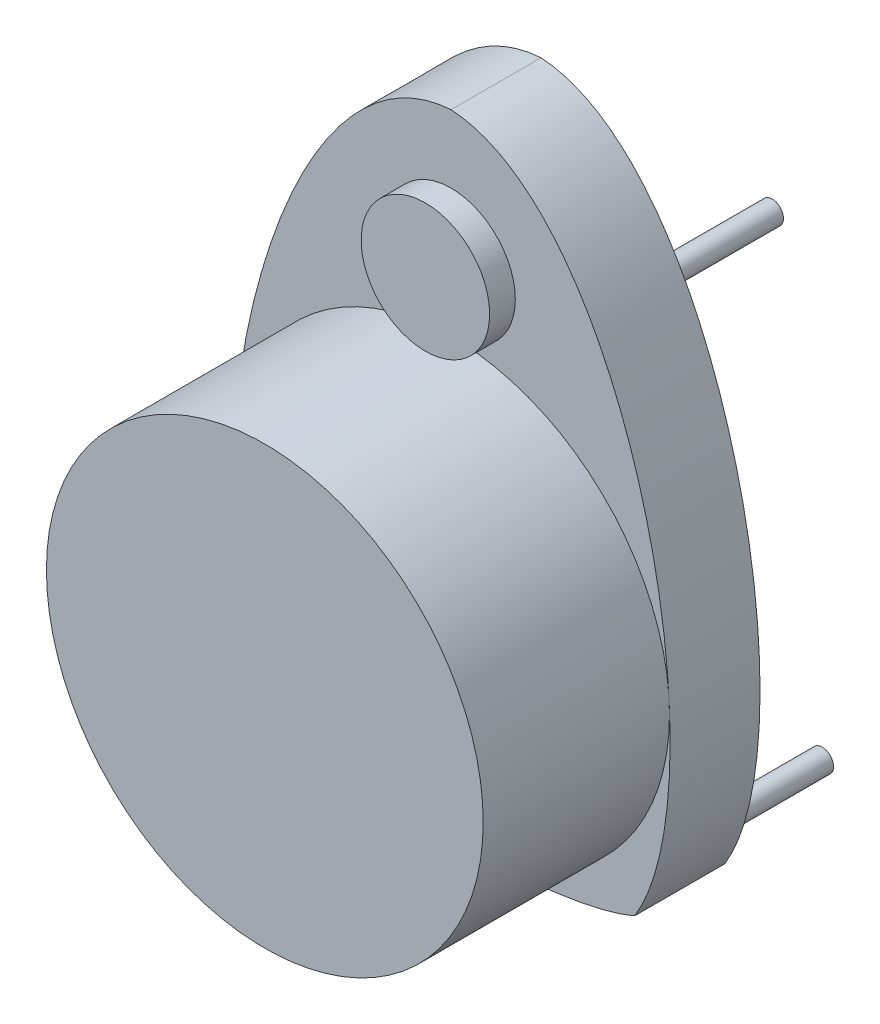
ISO-10303-21;
HEADER;
FILE_DESCRIPTION(('STEP AP214'),'2;1');
FILE_NAME('part.step','',(''),(''),'','','');
FILE_SCHEMA(('AUTOMOTIVE_DESIGN { 1 0 10303 214 1 1 1 1 }'));
ENDSEC;
DATA;
#1=APPLICATION_CONTEXT('core data for automotive mechanical design processes');
#2=APPLICATION_PROTOCOL_DEFINITION('international standard','automotive_design',2000,#1);
#3=PRODUCT_CONTEXT('',#1,'mechanical');
#4=PRODUCT('Part','Part','',(#3));
#5=PRODUCT_RELATED_PRODUCT_CATEGORY('part','',(#4));
#6=PRODUCT_DEFINITION_FORMATION('','',#4);
#7=PRODUCT_DEFINITION_CONTEXT('part definition',#1,'design');
#8=PRODUCT_DEFINITION('design','',#6,#7);
#9=PRODUCT_DEFINITION_SHAPE('','',#8);
#10=(LENGTH_UNIT() NAMED_UNIT(*) SI_UNIT(.MILLI.,.METRE.));
#11=(NAMED_UNIT(*) PLANE_ANGLE_UNIT() SI_UNIT($,.RADIAN.));
#12=(NAMED_UNIT(*) SI_UNIT($,.STERADIAN.) SOLID_ANGLE_UNIT());
#13=UNCERTAINTY_MEASURE_WITH_UNIT(LENGTH_MEASURE(1.E-05),#10,'distance_accuracy_value','');
#14=(GEOMETRIC_REPRESENTATION_CONTEXT(3) GLOBAL_UNCERTAINTY_ASSIGNED_CONTEXT((#13)) GLOBAL_UNIT_ASSIGNED_CONTEXT((#10,
#11,#12)) REPRESENTATION_CONTEXT('',''));
#15=CARTESIAN_POINT('',(0.,0.,0.));
#16=DIRECTION('',(0.,0.,1.));
#17=DIRECTION('',(1.,0.,0.));
#18=AXIS2_PLACEMENT_3D('',#15,#16,#17);
#19=CARTESIAN_POINT('',(28.6113177618945,-29.8036970612146,-14.));
#20=CARTESIAN_POINT('',(42.7740058519947,-6.41287401563133,-14.));
#21=CARTESIAN_POINT('',(28.2258406559311,62.7668121122814,-14.));
#22=CARTESIAN_POINT('',(0.,64.5689508839381,-14.));
#23=B_SPLINE_CURVE_WITH_KNOTS('',3,(#19,#20,#21,#22),.UNSPECIFIED.,.F.,.F.,(4,4),(0.,1.),.UNSPECIFIED.);
#24=DIRECTION('',(0.,0.,1.));
#25=VECTOR('',#24,1.);
#26=SURFACE_OF_LINEAR_EXTRUSION('',#23,#25);
#27=CARTESIAN_POINT('',(28.6113177618945,-29.8036970612146,0.));
#28=CARTESIAN_POINT('',(42.7740058519947,-6.41287401563133,0.));
#29=CARTESIAN_POINT('',(28.2258406559311,62.7668121122814,0.));
#30=CARTESIAN_POINT('',(0.,64.5689508839381,0.));
#31=B_SPLINE_CURVE_WITH_KNOTS('',3,(#27,#28,#29,#30),.UNSPECIFIED.,.F.,.F.,(4,4),(0.,1.),.UNSPECIFIED.);
#32=CARTESIAN_POINT('',(28.6113177618945,-29.8036970612146,0.));
#33=VERTEX_POINT('',#32);
#34=CARTESIAN_POINT('',(0.,64.5689508839381,0.));
#35=VERTEX_POINT('',#34);
#36=EDGE_CURVE('E134',#33,#35,#31,.T.);
#37=ORIENTED_EDGE('',*,*,#36,.F.);
#38=DIRECTION('',(0.,0.,1.));
#39=VECTOR('',#38,1.);
#40=CARTESIAN_POINT('',(28.6113177618945,-29.8036970612146,-14.));
#41=LINE('',#40,#39);
#42=CARTESIAN_POINT('',(28.6113177618945,-29.8036970612146,-14.));
#43=VERTEX_POINT('',#42);
#44=EDGE_CURVE('E59',#43,#33,#41,.T.);
#45=ORIENTED_EDGE('',*,*,#44,.F.);
#46=CARTESIAN_POINT('',(0.,64.5689508839381,-14.));
#47=VERTEX_POINT('',#46);
#48=EDGE_CURVE('E104',#43,#47,#23,.T.);
#49=ORIENTED_EDGE('',*,*,#48,.T.);
#50=DIRECTION('',(0.,0.,1.));
#51=VECTOR('',#50,1.);
#52=CARTESIAN_POINT('',(0.,64.5689508839381,-14.));
#53=LINE('',#52,#51);
#54=EDGE_CURVE('E87',#47,#35,#53,.T.);
#55=ORIENTED_EDGE('',*,*,#54,.T.);
#56=EDGE_LOOP('',(#37,#45,#49,#55));
#57=FACE_BOUND('',#56,.T.);
#58=ADVANCED_FACE('F42',(#57),#26,.T.);
#59=CARTESIAN_POINT('',(0.,-34.,-14.));
#60=CARTESIAN_POINT('',(20.277297814676,-33.507705926645,-14.));
#61=CARTESIAN_POINT('',(28.6113177618945,-29.8036970612146,-14.));
#62=B_SPLINE_CURVE_WITH_KNOTS('',2,(#59,#60,#61),.UNSPECIFIED.,.F.,.F.,(3,3),(0.,1.),.UNSPECIFIED.);
#63=DIRECTION('',(0.,0.,1.));
#64=VECTOR('',#63,1.);
#65=SURFACE_OF_LINEAR_EXTRUSION('',#62,#64);
#66=CARTESIAN_POINT('',(0.,-34.,0.));
#67=CARTESIAN_POINT('',(20.277297814676,-33.507705926645,0.));
#68=CARTESIAN_POINT('',(28.6113177618945,-29.8036970612146,0.));
#69=B_SPLINE_CURVE_WITH_KNOTS('',2,(#66,#67,#68),.UNSPECIFIED.,.F.,.F.,(3,3),(0.,1.),.UNSPECIFIED.);
#70=CARTESIAN_POINT('',(0.,-34.,0.));
#71=VERTEX_POINT('',#70);
#72=EDGE_CURVE('E106',#71,#33,#69,.T.);
#73=ORIENTED_EDGE('',*,*,#72,.F.);
#74=DIRECTION('',(0.,0.,1.));
#75=VECTOR('',#74,1.);
#76=CARTESIAN_POINT('',(0.,-34.,-14.));
#77=LINE('',#76,#75);
#78=CARTESIAN_POINT('',(0.,-34.,-14.));
#79=VERTEX_POINT('',#78);
#80=EDGE_CURVE('E76',#79,#71,#77,.T.);
#81=ORIENTED_EDGE('',*,*,#80,.F.);
#82=EDGE_CURVE('E101',#79,#43,#62,.T.);
#83=ORIENTED_EDGE('',*,*,#82,.T.);
#84=ORIENTED_EDGE('',*,*,#44,.T.);
#85=EDGE_LOOP('',(#73,#81,#83,#84));
#86=FACE_BOUND('',#85,.T.);
#87=ADVANCED_FACE('F125',(#86),#65,.T.);
#88=CARTESIAN_POINT('',(-28.6113177618945,-29.8036970612146,-14.));
#89=CARTESIAN_POINT('',(-20.277297814676,-33.507705926645,-14.));
#90=CARTESIAN_POINT('',(0.,-34.,-14.));
#91=B_SPLINE_CURVE_WITH_KNOTS('',2,(#88,#89,#90),.UNSPECIFIED.,.F.,.F.,(3,3),(0.,1.),.UNSPECIFIED.);
#92=DIRECTION('',(0.,0.,1.));
#93=VECTOR('',#92,1.);
#94=SURFACE_OF_LINEAR_EXTRUSION('',#91,#93);
#95=CARTESIAN_POINT('',(-28.6113177618945,-29.8036970612146,0.));
#96=CARTESIAN_POINT('',(-20.277297814676,-33.507705926645,0.));
#97=CARTESIAN_POINT('',(0.,-34.,0.));
#98=B_SPLINE_CURVE_WITH_KNOTS('',2,(#95,#96,#97),.UNSPECIFIED.,.F.,.F.,(3,3),(0.,1.),.UNSPECIFIED.);
#99=CARTESIAN_POINT('',(-28.6113177618945,-29.8036970612146,0.));
#100=VERTEX_POINT('',#99);
#101=EDGE_CURVE('E95',#100,#71,#98,.T.);
#102=ORIENTED_EDGE('',*,*,#101,.F.);
#103=DIRECTION('',(0.,0.,1.));
#104=VECTOR('',#103,1.);
#105=CARTESIAN_POINT('',(-28.6113177618945,-29.8036970612146,-14.));
#106=LINE('',#105,#104);
#107=CARTESIAN_POINT('',(-28.6113177618945,-29.8036970612146,-14.));
#108=VERTEX_POINT('',#107);
#109=EDGE_CURVE('E90',#108,#100,#106,.T.);
#110=ORIENTED_EDGE('',*,*,#109,.F.);
#111=EDGE_CURVE('E93',#108,#79,#91,.T.);
#112=ORIENTED_EDGE('',*,*,#111,.T.);
#113=ORIENTED_EDGE('',*,*,#80,.T.);
#114=EDGE_LOOP('',(#102,#110,#112,#113));
#115=FACE_BOUND('',#114,.T.);
#116=ADVANCED_FACE('F92',(#115),#94,.T.);
#117=CARTESIAN_POINT('',(0.,64.5689508839381,-14.));
#118=CARTESIAN_POINT('',(-28.2258406559311,62.7668121122814,-14.));
#119=CARTESIAN_POINT('',(-42.7740058519947,-6.41287401563133,-14.));
#120=CARTESIAN_POINT('',(-28.6113177618945,-29.8036970612146,-14.));
#121=B_SPLINE_CURVE_WITH_KNOTS('',3,(#117,#118,#119,#120),.UNSPECIFIED.,.F.,.F.,(4,4),(0.,1.),.UNSPECIFIED.);
#122=DIRECTION('',(0.,0.,1.));
#123=VECTOR('',#122,1.);
#124=SURFACE_OF_LINEAR_EXTRUSION('',#121,#123);
#125=CARTESIAN_POINT('',(0.,64.5689508839381,0.));
#126=CARTESIAN_POINT('',(-28.2258406559311,62.7668121122814,0.));
#127=CARTESIAN_POINT('',(-42.7740058519947,-6.41287401563133,0.));
#128=CARTESIAN_POINT('',(-28.6113177618945,-29.8036970612146,0.));
#129=B_SPLINE_CURVE_WITH_KNOTS('',3,(#125,#126,#127,#128),.UNSPECIFIED.,.F.,.F.,(4,4),(0.,1.),.UNSPECIFIED.);
#130=EDGE_CURVE('E142',#35,#100,#129,.T.);
#131=ORIENTED_EDGE('',*,*,#130,.F.);
#132=ORIENTED_EDGE('',*,*,#54,.F.);
#133=EDGE_CURVE('E100',#47,#108,#121,.T.);
#134=ORIENTED_EDGE('',*,*,#133,.T.);
#135=ORIENTED_EDGE('',*,*,#109,.T.);
#136=EDGE_LOOP('',(#131,#132,#134,#135));
#137=FACE_BOUND('',#136,.T.);
#138=ADVANCED_FACE('F103',(#137),#124,.T.);
#139=CARTESIAN_POINT('',(30.201357160709,25.4783835140842,-14.));
#140=DIRECTION('',(0.,0.,1.));
#141=DIRECTION('',(1.,0.,0.));
#142=AXIS2_PLACEMENT_3D('',#139,#140,#141);
#143=PLANE('',#142);
#144=CARTESIAN_POINT('',(20.,45.7689508839381,-14.));
#145=DIRECTION('',(0.,0.,1.));
#146=DIRECTION('',(1.,0.,0.));
#147=AXIS2_PLACEMENT_3D('',#144,#145,#146);
#148=CIRCLE('',#147,1.75);
#149=CARTESIAN_POINT('',(21.75,45.7689508839381,-14.));
#150=VERTEX_POINT('',#149);
#151=EDGE_CURVE('E12',#150,#150,#148,.F.);
#152=ORIENTED_EDGE('',*,*,#151,.F.);
#153=EDGE_LOOP('',(#152));
#154=FACE_BOUND('',#153,.T.);
#155=CARTESIAN_POINT('',(-27.8,-24.2310491160619,-14.));
#156=DIRECTION('',(0.,0.,1.));
#157=DIRECTION('',(1.,0.,0.));
#158=AXIS2_PLACEMENT_3D('',#155,#156,#157);
#159=CIRCLE('',#158,1.75);
#160=CARTESIAN_POINT('',(-26.05,-24.2310491160619,-14.));
#161=VERTEX_POINT('',#160);
#162=EDGE_CURVE('E51',#161,#161,#159,.F.);
#163=ORIENTED_EDGE('',*,*,#162,.F.);
#164=EDGE_LOOP('',(#163));
#165=FACE_BOUND('',#164,.T.);
#166=CARTESIAN_POINT('',(-20.,45.7689508839381,-14.));
#167=DIRECTION('',(0.,0.,1.));
#168=DIRECTION('',(1.,0.,0.));
#169=AXIS2_PLACEMENT_3D('',#166,#167,#168);
#170=CIRCLE('',#169,1.75);
#171=CARTESIAN_POINT('',(-18.25,45.7689508839381,-14.));
#172=VERTEX_POINT('',#171);
#173=EDGE_CURVE('E172',#172,#172,#170,.F.);
#174=ORIENTED_EDGE('',*,*,#173,.F.);
#175=EDGE_LOOP('',(#174));
#176=FACE_BOUND('',#175,.T.);
#177=CARTESIAN_POINT('',(27.8,-24.2310491160619,-14.));
#178=DIRECTION('',(0.,0.,1.));
#179=DIRECTION('',(1.,0.,0.));
#180=AXIS2_PLACEMENT_3D('',#177,#178,#179);
#181=CIRCLE('',#180,1.75);
#182=CARTESIAN_POINT('',(29.55,-24.2310491160619,-14.));
#183=VERTEX_POINT('',#182);
#184=EDGE_CURVE('E167',#183,#183,#181,.F.);
#185=ORIENTED_EDGE('',*,*,#184,.F.);
#186=EDGE_LOOP('',(#185));
#187=FACE_BOUND('',#186,.T.);
#188=ORIENTED_EDGE('',*,*,#48,.F.);
#189=ORIENTED_EDGE('',*,*,#82,.F.);
#190=ORIENTED_EDGE('',*,*,#111,.F.);
#191=ORIENTED_EDGE('',*,*,#133,.F.);
#192=EDGE_LOOP('',(#188,#189,#190,#191));
#193=FACE_BOUND('',#192,.T.);
#194=ADVANCED_FACE('F99',(#154,#165,#176,#187,#193),#143,.F.);
#195=CARTESIAN_POINT('',(30.201357160709,25.4783835140842,0.));
#196=DIRECTION('',(0.,0.,1.));
#197=DIRECTION('',(1.,0.,0.));
#198=AXIS2_PLACEMENT_3D('',#195,#196,#197);
#199=PLANE('',#198);
#200=ORIENTED_EDGE('',*,*,#36,.T.);
#201=ORIENTED_EDGE('',*,*,#130,.T.);
#202=ORIENTED_EDGE('',*,*,#101,.T.);
#203=ORIENTED_EDGE('',*,*,#72,.T.);
#204=EDGE_LOOP('',(#200,#201,#202,#203));
#205=FACE_BOUND('',#204,.T.);
#206=ADVANCED_FACE('F128',(#205),#199,.T.);
#207=CARTESIAN_POINT('',(27.8,-24.2310491160619,-30.));
#208=DIRECTION('',(0.,0.,1.));
#209=DIRECTION('',(1.,0.,0.));
#210=AXIS2_PLACEMENT_3D('',#207,#208,#209);
#211=CYLINDRICAL_SURFACE('',#210,1.75);
#212=CARTESIAN_POINT('',(27.8,-24.2310491160619,-30.));
#213=DIRECTION('',(0.,0.,-1.));
#214=DIRECTION('',(-1.,0.,0.));
#215=AXIS2_PLACEMENT_3D('',#212,#213,#214);
#216=CIRCLE('',#215,1.75);
#217=CARTESIAN_POINT('',(26.05,-24.2310491160619,-30.));
#218=VERTEX_POINT('',#217);
#219=EDGE_CURVE('E143',#218,#218,#216,.T.);
#220=ORIENTED_EDGE('',*,*,#219,.F.);
#221=EDGE_LOOP('',(#220));
#222=FACE_BOUND('',#221,.T.);
#223=ORIENTED_EDGE('',*,*,#184,.T.);
#224=EDGE_LOOP('',(#223));
#225=FACE_BOUND('',#224,.T.);
#226=ADVANCED_FACE('F186',(#222,#225),#211,.T.);
#227=CARTESIAN_POINT('',(27.8,-24.2310491160619,-30.));
#228=DIRECTION('',(0.,0.,-1.));
#229=DIRECTION('',(-1.,0.,0.));
#230=AXIS2_PLACEMENT_3D('',#227,#228,#229);
#231=PLANE('',#230);
#232=ORIENTED_EDGE('',*,*,#219,.T.);
#233=EDGE_LOOP('',(#232));
#234=FACE_BOUND('',#233,.T.);
#235=ADVANCED_FACE('F188',(#234),#231,.T.);
#236=CARTESIAN_POINT('',(-20.,45.7689508839381,-30.));
#237=DIRECTION('',(0.,0.,1.));
#238=DIRECTION('',(1.,0.,0.));
#239=AXIS2_PLACEMENT_3D('',#236,#237,#238);
#240=CYLINDRICAL_SURFACE('',#239,1.75);
#241=CARTESIAN_POINT('',(-20.,45.7689508839381,-30.));
#242=DIRECTION('',(0.,0.,-1.));
#243=DIRECTION('',(-1.,0.,0.));
#244=AXIS2_PLACEMENT_3D('',#241,#242,#243);
#245=CIRCLE('',#244,1.75);
#246=CARTESIAN_POINT('',(-21.75,45.7689508839381,-30.));
#247=VERTEX_POINT('',#246);
#248=EDGE_CURVE('E303',#247,#247,#245,.T.);
#249=ORIENTED_EDGE('',*,*,#248,.F.);
#250=EDGE_LOOP('',(#249));
#251=FACE_BOUND('',#250,.T.);
#252=ORIENTED_EDGE('',*,*,#173,.T.);
#253=EDGE_LOOP('',(#252));
#254=FACE_BOUND('',#253,.T.);
#255=ADVANCED_FACE('F195',(#251,#254),#240,.T.);
#256=CARTESIAN_POINT('',(-20.,45.7689508839381,-30.));
#257=DIRECTION('',(0.,0.,-1.));
#258=DIRECTION('',(-1.,0.,0.));
#259=AXIS2_PLACEMENT_3D('',#256,#257,#258);
#260=PLANE('',#259);
#261=ORIENTED_EDGE('',*,*,#248,.T.);
#262=EDGE_LOOP('',(#261));
#263=FACE_BOUND('',#262,.T.);
#264=ADVANCED_FACE('F244',(#263),#260,.T.);
#265=CARTESIAN_POINT('',(-27.8,-24.2310491160619,-30.));
#266=DIRECTION('',(0.,0.,1.));
#267=DIRECTION('',(1.,0.,0.));
#268=AXIS2_PLACEMENT_3D('',#265,#266,#267);
#269=CYLINDRICAL_SURFACE('',#268,1.75);
#270=CARTESIAN_POINT('',(-27.8,-24.2310491160619,-30.));
#271=DIRECTION('',(0.,0.,-1.));
#272=DIRECTION('',(-1.,0.,0.));
#273=AXIS2_PLACEMENT_3D('',#270,#271,#272);
#274=CIRCLE('',#273,1.75);
#275=CARTESIAN_POINT('',(-29.55,-24.2310491160619,-30.));
#276=VERTEX_POINT('',#275);
#277=EDGE_CURVE('E300',#276,#276,#274,.T.);
#278=ORIENTED_EDGE('',*,*,#277,.F.);
#279=EDGE_LOOP('',(#278));
#280=FACE_BOUND('',#279,.T.);
#281=ORIENTED_EDGE('',*,*,#162,.T.);
#282=EDGE_LOOP('',(#281));
#283=FACE_BOUND('',#282,.T.);
#284=ADVANCED_FACE('F177',(#280,#283),#269,.T.);
#285=CARTESIAN_POINT('',(-27.8,-24.2310491160619,-30.));
#286=DIRECTION('',(0.,0.,-1.));
#287=DIRECTION('',(-1.,0.,0.));
#288=AXIS2_PLACEMENT_3D('',#285,#286,#287);
#289=PLANE('',#288);
#290=ORIENTED_EDGE('',*,*,#277,.T.);
#291=EDGE_LOOP('',(#290));
#292=FACE_BOUND('',#291,.T.);
#293=ADVANCED_FACE('F261',(#292),#289,.T.);
#294=CARTESIAN_POINT('',(20.,45.7689508839381,-30.));
#295=DIRECTION('',(0.,0.,1.));
#296=DIRECTION('',(1.,0.,0.));
#297=AXIS2_PLACEMENT_3D('',#294,#295,#296);
#298=CYLINDRICAL_SURFACE('',#297,1.75);
#299=CARTESIAN_POINT('',(20.,45.7689508839381,-30.));
#300=DIRECTION('',(0.,0.,-1.));
#301=DIRECTION('',(-1.,0.,0.));
#302=AXIS2_PLACEMENT_3D('',#299,#300,#301);
#303=CIRCLE('',#302,1.75);
#304=CARTESIAN_POINT('',(18.25,45.7689508839381,-30.));
#305=VERTEX_POINT('',#304);
#306=EDGE_CURVE('E299',#305,#305,#303,.T.);
#307=ORIENTED_EDGE('',*,*,#306,.F.);
#308=EDGE_LOOP('',(#307));
#309=FACE_BOUND('',#308,.T.);
#310=ORIENTED_EDGE('',*,*,#151,.T.);
#311=EDGE_LOOP('',(#310));
#312=FACE_BOUND('',#311,.T.);
#313=ADVANCED_FACE('F270',(#309,#312),#298,.T.);
#314=CARTESIAN_POINT('',(20.,45.7689508839381,-30.));
#315=DIRECTION('',(0.,0.,-1.));
#316=DIRECTION('',(-1.,0.,0.));
#317=AXIS2_PLACEMENT_3D('',#314,#315,#316);
#318=PLANE('',#317);
#319=ORIENTED_EDGE('',*,*,#306,.T.);
#320=EDGE_LOOP('',(#319));
#321=FACE_BOUND('',#320,.T.);
#322=ADVANCED_FACE('F279',(#321),#318,.T.);
#323=CLOSED_SHELL('',(#58,#87,#116,#138,#194,#206,#226,#235,#255,#264,#284,#293,#313,#322));
#324=MANIFOLD_SOLID_BREP('B2',#323);
#325=CARTESIAN_POINT('',(0.,44.,4.));
#326=DIRECTION('',(0.,0.,-1.));
#327=DIRECTION('',(-1.,0.,0.));
#328=AXIS2_PLACEMENT_3D('',#325,#326,#327);
#329=CYLINDRICAL_SURFACE('',#328,10.);
#330=CARTESIAN_POINT('',(0.,44.,4.));
#331=DIRECTION('',(0.,0.,1.));
#332=DIRECTION('',(1.,0.,0.));
#333=AXIS2_PLACEMENT_3D('',#330,#331,#332);
#334=CIRCLE('',#333,10.);
#335=CARTESIAN_POINT('',(10.,44.,4.));
#336=VERTEX_POINT('',#335);
#337=EDGE_CURVE('E41',#336,#336,#334,.T.);
#338=ORIENTED_EDGE('',*,*,#337,.F.);
#339=EDGE_LOOP('',(#338));
#340=FACE_BOUND('',#339,.T.);
#341=CARTESIAN_POINT('',(0.,44.,0.));
#342=DIRECTION('',(0.,0.,1.));
#343=DIRECTION('',(1.,0.,0.));
#344=AXIS2_PLACEMENT_3D('',#341,#342,#343);
#345=CIRCLE('',#344,10.);
#346=CARTESIAN_POINT('',(10.,44.,0.));
#347=VERTEX_POINT('',#346);
#348=EDGE_CURVE('E340',#347,#347,#345,.T.);
#349=ORIENTED_EDGE('',*,*,#348,.T.);
#350=EDGE_LOOP('',(#349));
#351=FACE_BOUND('',#350,.T.);
#352=ADVANCED_FACE('F337',(#340,#351),#329,.T.);
#353=CARTESIAN_POINT('',(0.,44.,4.));
#354=DIRECTION('',(0.,0.,1.));
#355=DIRECTION('',(1.,0.,0.));
#356=AXIS2_PLACEMENT_3D('',#353,#354,#355);
#357=PLANE('',#356);
#358=ORIENTED_EDGE('',*,*,#337,.T.);
#359=EDGE_LOOP('',(#358));
#360=FACE_BOUND('',#359,.T.);
#361=ADVANCED_FACE('F352',(#360),#357,.T.);
#362=CARTESIAN_POINT('',(0.,44.,0.));
#363=DIRECTION('',(0.,0.,1.));
#364=DIRECTION('',(1.,0.,0.));
#365=AXIS2_PLACEMENT_3D('',#362,#363,#364);
#366=PLANE('',#365);
#367=ORIENTED_EDGE('',*,*,#348,.F.);
#368=EDGE_LOOP('',(#367));
#369=FACE_BOUND('',#368,.T.);
#370=ADVANCED_FACE('F350',(#369),#366,.F.);
#371=CLOSED_SHELL('',(#352,#361,#370));
#372=MANIFOLD_SOLID_BREP('B6',#371);
#373=CARTESIAN_POINT('',(0.,0.,29.));
#374=DIRECTION('',(0.,0.,-1.));
#375=DIRECTION('',(-1.,0.,0.));
#376=AXIS2_PLACEMENT_3D('',#373,#374,#375);
#377=CYLINDRICAL_SURFACE('',#376,34.);
#378=CARTESIAN_POINT('',(0.,0.,0.));
#379=DIRECTION('',(0.,0.,1.));
#380=DIRECTION('',(1.,0.,0.));
#381=AXIS2_PLACEMENT_3D('',#378,#379,#380);
#382=CIRCLE('',#381,34.);
#383=CARTESIAN_POINT('',(34.,0.,0.));
#384=VERTEX_POINT('',#383);
#385=EDGE_CURVE('E381',#384,#384,#382,.T.);
#386=ORIENTED_EDGE('',*,*,#385,.T.);
#387=EDGE_LOOP('',(#386));
#388=FACE_BOUND('',#387,.T.);
#389=CARTESIAN_POINT('',(0.,0.,29.));
#390=DIRECTION('',(0.,0.,1.));
#391=DIRECTION('',(1.,0.,0.));
#392=AXIS2_PLACEMENT_3D('',#389,#390,#391);
#393=CIRCLE('',#392,34.);
#394=CARTESIAN_POINT('',(34.,0.,29.));
#395=VERTEX_POINT('',#394);
#396=EDGE_CURVE('E336',#395,#395,#393,.T.);
#397=ORIENTED_EDGE('',*,*,#396,.F.);
#398=EDGE_LOOP('',(#397));
#399=FACE_BOUND('',#398,.T.);
#400=ADVANCED_FACE('F378',(#388,#399),#377,.T.);
#401=CARTESIAN_POINT('',(0.,0.,29.));
#402=DIRECTION('',(0.,0.,1.));
#403=DIRECTION('',(1.,0.,0.));
#404=AXIS2_PLACEMENT_3D('',#401,#402,#403);
#405=PLANE('',#404);
#406=ORIENTED_EDGE('',*,*,#396,.T.);
#407=EDGE_LOOP('',(#406));
#408=FACE_BOUND('',#407,.T.);
#409=ADVANCED_FACE('F394',(#408),#405,.T.);
#410=CARTESIAN_POINT('',(0.,0.,0.));
#411=DIRECTION('',(0.,0.,1.));
#412=DIRECTION('',(1.,0.,0.));
#413=AXIS2_PLACEMENT_3D('',#410,#411,#412);
#414=PLANE('',#413);
#415=ORIENTED_EDGE('',*,*,#385,.F.);
#416=EDGE_LOOP('',(#415));
#417=FACE_BOUND('',#416,.T.);
#418=ADVANCED_FACE('F392',(#417),#414,.F.);
#419=CLOSED_SHELL('',(#400,#409,#418));
#420=MANIFOLD_SOLID_BREP('B36',#419);
#421=ADVANCED_BREP_SHAPE_REPRESENTATION('',(#18,#324,#372,#420),#14);
#422=SHAPE_DEFINITION_REPRESENTATION(#9,#421);
ENDSEC;
END-ISO-10303-21;
